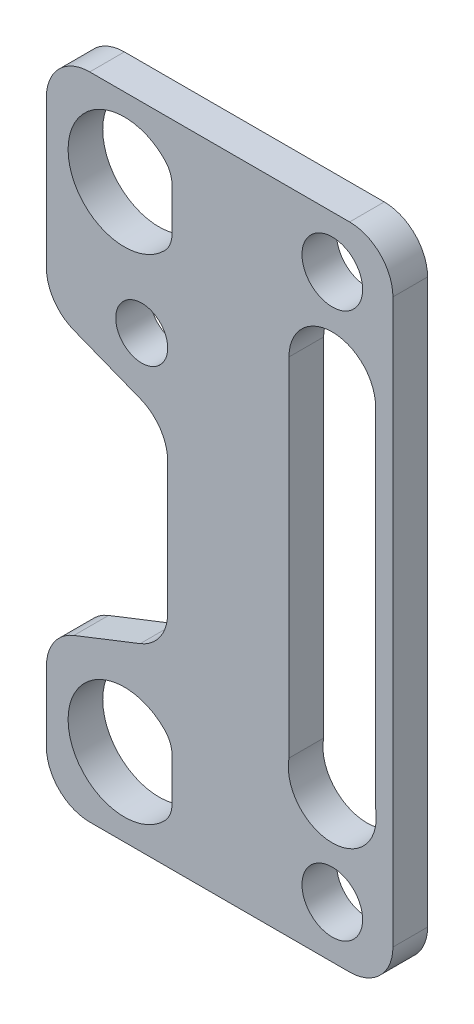
ISO-10303-21;
HEADER;
FILE_DESCRIPTION(('STEP AP214'),'2;1');
FILE_NAME('part.step','',(''),(''),'','','');
FILE_SCHEMA(('AUTOMOTIVE_DESIGN { 1 0 10303 214 1 1 1 1 }'));
ENDSEC;
DATA;
#1=APPLICATION_CONTEXT('core data for automotive mechanical design processes');
#2=APPLICATION_PROTOCOL_DEFINITION('international standard','automotive_design',2000,#1);
#3=PRODUCT_CONTEXT('',#1,'mechanical');
#4=PRODUCT('Part','Part','',(#3));
#5=PRODUCT_RELATED_PRODUCT_CATEGORY('part','',(#4));
#6=PRODUCT_DEFINITION_FORMATION('','',#4);
#7=PRODUCT_DEFINITION_CONTEXT('part definition',#1,'design');
#8=PRODUCT_DEFINITION('design','',#6,#7);
#9=PRODUCT_DEFINITION_SHAPE('','',#8);
#10=(LENGTH_UNIT() NAMED_UNIT(*) SI_UNIT(.MILLI.,.METRE.));
#11=(NAMED_UNIT(*) PLANE_ANGLE_UNIT() SI_UNIT($,.RADIAN.));
#12=(NAMED_UNIT(*) SI_UNIT($,.STERADIAN.) SOLID_ANGLE_UNIT());
#13=UNCERTAINTY_MEASURE_WITH_UNIT(LENGTH_MEASURE(1.E-05),#10,'distance_accuracy_value','');
#14=(GEOMETRIC_REPRESENTATION_CONTEXT(3) GLOBAL_UNCERTAINTY_ASSIGNED_CONTEXT((#13)) GLOBAL_UNIT_ASSIGNED_CONTEXT((#10,
#11,#12)) REPRESENTATION_CONTEXT('',''));
#15=CARTESIAN_POINT('',(0.,0.,0.));
#16=DIRECTION('',(0.,0.,1.));
#17=DIRECTION('',(1.,0.,0.));
#18=AXIS2_PLACEMENT_3D('',#15,#16,#17);
#19=CARTESIAN_POINT('',(0.,0.,4.));
#20=DIRECTION('',(1.,0.,0.));
#21=DIRECTION('',(0.,0.,-1.));
#22=AXIS2_PLACEMENT_3D('',#19,#20,#21);
#23=PLANE('',#22);
#24=DIRECTION('',(0.,-1.,0.));
#25=VECTOR('',#24,1.);
#26=CARTESIAN_POINT('',(0.,0.,4.));
#27=LINE('',#26,#25);
#28=CARTESIAN_POINT('',(0.,70.,4.));
#29=VERTEX_POINT('',#28);
#30=CARTESIAN_POINT('',(0.,52.9077174844612,4.));
#31=VERTEX_POINT('',#30);
#32=EDGE_CURVE('E308',#29,#31,#27,.T.);
#33=ORIENTED_EDGE('',*,*,#32,.F.);
#34=DIRECTION('',(0.,0.,-1.));
#35=VECTOR('',#34,1.);
#36=CARTESIAN_POINT('',(0.,70.,4.));
#37=LINE('',#36,#35);
#38=CARTESIAN_POINT('',(0.,70.,0.));
#39=VERTEX_POINT('',#38);
#40=EDGE_CURVE('E375',#29,#39,#37,.T.);
#41=ORIENTED_EDGE('',*,*,#40,.T.);
#42=DIRECTION('',(0.,-1.,0.));
#43=VECTOR('',#42,1.);
#44=CARTESIAN_POINT('',(0.,0.,0.));
#45=LINE('',#44,#43);
#46=CARTESIAN_POINT('',(0.,52.9077174844612,0.));
#47=VERTEX_POINT('',#46);
#48=EDGE_CURVE('E324',#39,#47,#45,.T.);
#49=ORIENTED_EDGE('',*,*,#48,.T.);
#50=DIRECTION('',(0.,0.,1.));
#51=VECTOR('',#50,1.);
#52=CARTESIAN_POINT('',(0.,52.9077174844612,4.));
#53=LINE('',#52,#51);
#54=EDGE_CURVE('E372',#47,#31,#53,.T.);
#55=ORIENTED_EDGE('',*,*,#54,.T.);
#56=EDGE_LOOP('',(#33,#41,#49,#55));
#57=FACE_BOUND('',#56,.T.);
#58=ADVANCED_FACE('F34',(#57),#23,.F.);
#59=CARTESIAN_POINT('',(0.,0.,4.));
#60=DIRECTION('',(0.,0.,-1.));
#61=DIRECTION('',(-1.,0.,0.));
#62=AXIS2_PLACEMENT_3D('',#59,#60,#61);
#63=PLANE('',#62);
#64=CARTESIAN_POINT('',(9.,9.,4.));
#65=DIRECTION('',(0.,0.,1.));
#66=DIRECTION('',(1.,0.,0.));
#67=AXIS2_PLACEMENT_3D('',#64,#65,#66);
#68=CIRCLE('',#67,6.5);
#69=CARTESIAN_POINT('',(13.6428571428571,13.5490523794545,4.));
#70=VERTEX_POINT('',#69);
#71=CARTESIAN_POINT('',(13.6428571428571,4.45094762054552,4.));
#72=VERTEX_POINT('',#71);
#73=EDGE_CURVE('E276',#70,#72,#68,.T.);
#74=ORIENTED_EDGE('',*,*,#73,.F.);
#75=CARTESIAN_POINT('',(11.5,11.4494897427832,4.));
#76=DIRECTION('',(0.,0.,-1.));
#77=DIRECTION('',(-1.,0.,0.));
#78=AXIS2_PLACEMENT_3D('',#75,#76,#77);
#79=CIRCLE('',#78,3.);
#80=CARTESIAN_POINT('',(14.5,11.4494897427832,4.));
#81=VERTEX_POINT('',#80);
#82=EDGE_CURVE('E434',#70,#81,#79,.T.);
#83=ORIENTED_EDGE('',*,*,#82,.T.);
#84=DIRECTION('',(0.,-1.,0.));
#85=VECTOR('',#84,1.);
#86=CARTESIAN_POINT('',(14.5,16.4524191540707,4.));
#87=LINE('',#86,#85);
#88=CARTESIAN_POINT('',(14.5,6.55051025721682,4.));
#89=VERTEX_POINT('',#88);
#90=EDGE_CURVE('E587',#81,#89,#87,.T.);
#91=ORIENTED_EDGE('',*,*,#90,.T.);
#92=CARTESIAN_POINT('',(11.5,6.55051025721682,4.));
#93=DIRECTION('',(0.,0.,-1.));
#94=DIRECTION('',(-1.,0.,0.));
#95=AXIS2_PLACEMENT_3D('',#92,#93,#94);
#96=CIRCLE('',#95,3.);
#97=EDGE_CURVE('E432',#89,#72,#96,.T.);
#98=ORIENTED_EDGE('',*,*,#97,.T.);
#99=EDGE_LOOP('',(#74,#83,#91,#98));
#100=FACE_BOUND('',#99,.T.);
#101=CARTESIAN_POINT('',(8.99999999999999,66.,4.));
#102=DIRECTION('',(0.,0.,1.));
#103=DIRECTION('',(1.,0.,0.));
#104=AXIS2_PLACEMENT_3D('',#101,#102,#103);
#105=CIRCLE('',#104,6.50000000000001);
#106=CARTESIAN_POINT('',(13.6428571428571,70.5490523794545,4.));
#107=VERTEX_POINT('',#106);
#108=CARTESIAN_POINT('',(13.6428571428571,61.4509476205455,4.));
#109=VERTEX_POINT('',#108);
#110=EDGE_CURVE('E280',#107,#109,#105,.T.);
#111=ORIENTED_EDGE('',*,*,#110,.F.);
#112=CARTESIAN_POINT('',(11.5,68.4494897427832,4.));
#113=DIRECTION('',(0.,0.,-1.));
#114=DIRECTION('',(-1.,0.,0.));
#115=AXIS2_PLACEMENT_3D('',#112,#113,#114);
#116=CIRCLE('',#115,3.);
#117=CARTESIAN_POINT('',(14.5,68.4494897427832,4.));
#118=VERTEX_POINT('',#117);
#119=EDGE_CURVE('E42',#107,#118,#116,.T.);
#120=ORIENTED_EDGE('',*,*,#119,.T.);
#121=DIRECTION('',(0.,-1.,0.));
#122=VECTOR('',#121,1.);
#123=CARTESIAN_POINT('',(14.5,71.691919872241,4.));
#124=LINE('',#123,#122);
#125=CARTESIAN_POINT('',(14.5,63.5505102572168,4.));
#126=VERTEX_POINT('',#125);
#127=EDGE_CURVE('E247',#118,#126,#124,.T.);
#128=ORIENTED_EDGE('',*,*,#127,.T.);
#129=CARTESIAN_POINT('',(11.5,63.5505102572168,4.));
#130=DIRECTION('',(0.,0.,-1.));
#131=DIRECTION('',(-1.,0.,0.));
#132=AXIS2_PLACEMENT_3D('',#129,#130,#131);
#133=CIRCLE('',#132,3.);
#134=EDGE_CURVE('E439',#126,#109,#133,.T.);
#135=ORIENTED_EDGE('',*,*,#134,.T.);
#136=EDGE_LOOP('',(#111,#120,#128,#135));
#137=FACE_BOUND('',#136,.T.);
#138=DIRECTION('',(0.,-1.,0.));
#139=VECTOR('',#138,1.);
#140=CARTESIAN_POINT('',(28.,58.,4.));
#141=LINE('',#140,#139);
#142=CARTESIAN_POINT('',(28.,58.,4.));
#143=VERTEX_POINT('',#142);
#144=CARTESIAN_POINT('',(28.,17.9014467678342,4.));
#145=VERTEX_POINT('',#144);
#146=EDGE_CURVE('E257',#143,#145,#141,.T.);
#147=ORIENTED_EDGE('',*,*,#146,.F.);
#148=CARTESIAN_POINT('',(33.,58.,4.));
#149=DIRECTION('',(0.,0.,1.));
#150=DIRECTION('',(1.,0.,0.));
#151=AXIS2_PLACEMENT_3D('',#148,#149,#150);
#152=CIRCLE('',#151,5.);
#153=CARTESIAN_POINT('',(38.,58.,4.));
#154=VERTEX_POINT('',#153);
#155=EDGE_CURVE('E227',#154,#143,#152,.T.);
#156=ORIENTED_EDGE('',*,*,#155,.F.);
#157=DIRECTION('',(0.,1.,0.));
#158=VECTOR('',#157,1.);
#159=CARTESIAN_POINT('',(38.,17.9014467678342,4.));
#160=LINE('',#159,#158);
#161=CARTESIAN_POINT('',(38.,17.9014467678342,4.));
#162=VERTEX_POINT('',#161);
#163=EDGE_CURVE('E409',#162,#154,#160,.T.);
#164=ORIENTED_EDGE('',*,*,#163,.F.);
#165=CARTESIAN_POINT('',(33.,17.,4.));
#166=DIRECTION('',(0.,0.,1.));
#167=DIRECTION('',(1.,0.,0.));
#168=AXIS2_PLACEMENT_3D('',#165,#166,#167);
#169=CIRCLE('',#168,5.08061081713988);
#170=EDGE_CURVE('E407',#145,#162,#169,.T.);
#171=ORIENTED_EDGE('',*,*,#170,.F.);
#172=EDGE_LOOP('',(#147,#156,#164,#171));
#173=FACE_BOUND('',#172,.T.);
#174=CARTESIAN_POINT('',(33.,6.,4.));
#175=DIRECTION('',(0.,0.,1.));
#176=DIRECTION('',(1.,0.,0.));
#177=AXIS2_PLACEMENT_3D('',#174,#175,#176);
#178=CIRCLE('',#177,3.5);
#179=CARTESIAN_POINT('',(36.5,6.,4.));
#180=VERTEX_POINT('',#179);
#181=EDGE_CURVE('E264',#180,#180,#178,.T.);
#182=ORIENTED_EDGE('',*,*,#181,.F.);
#183=EDGE_LOOP('',(#182));
#184=FACE_BOUND('',#183,.T.);
#185=CARTESIAN_POINT('',(33.,69.,4.));
#186=DIRECTION('',(0.,0.,1.));
#187=DIRECTION('',(1.,0.,0.));
#188=AXIS2_PLACEMENT_3D('',#185,#186,#187);
#189=CIRCLE('',#188,3.5);
#190=CARTESIAN_POINT('',(36.5,69.,4.));
#191=VERTEX_POINT('',#190);
#192=EDGE_CURVE('E263',#191,#191,#189,.T.);
#193=ORIENTED_EDGE('',*,*,#192,.F.);
#194=EDGE_LOOP('',(#193));
#195=FACE_BOUND('',#194,.T.);
#196=CARTESIAN_POINT('',(11.,51.8905235434662,4.));
#197=DIRECTION('',(0.,0.,1.));
#198=DIRECTION('',(1.,0.,0.));
#199=AXIS2_PLACEMENT_3D('',#196,#197,#198);
#200=CIRCLE('',#199,3.);
#201=CARTESIAN_POINT('',(14.,51.8905235434662,4.));
#202=VERTEX_POINT('',#201);
#203=EDGE_CURVE('E273',#202,#202,#200,.T.);
#204=ORIENTED_EDGE('',*,*,#203,.F.);
#205=EDGE_LOOP('',(#204));
#206=FACE_BOUND('',#205,.T.);
#207=DIRECTION('',(1.,0.,0.));
#208=VECTOR('',#207,1.);
#209=CARTESIAN_POINT('',(0.,0.,4.));
#210=LINE('',#209,#208);
#211=CARTESIAN_POINT('',(5.,0.,4.));
#212=VERTEX_POINT('',#211);
#213=CARTESIAN_POINT('',(35.,0.,4.));
#214=VERTEX_POINT('',#213);
#215=EDGE_CURVE('E311',#212,#214,#210,.T.);
#216=ORIENTED_EDGE('',*,*,#215,.T.);
#217=CARTESIAN_POINT('',(35.,5.,4.));
#218=DIRECTION('',(0.,0.,-1.));
#219=DIRECTION('',(-1.,0.,0.));
#220=AXIS2_PLACEMENT_3D('',#217,#218,#219);
#221=CIRCLE('',#220,5.);
#222=CARTESIAN_POINT('',(40.,5.,4.));
#223=VERTEX_POINT('',#222);
#224=EDGE_CURVE('E365',#214,#223,#221,.F.);
#225=ORIENTED_EDGE('',*,*,#224,.T.);
#226=DIRECTION('',(0.,1.,0.));
#227=VECTOR('',#226,1.);
#228=CARTESIAN_POINT('',(40.,0.,4.));
#229=LINE('',#228,#227);
#230=CARTESIAN_POINT('',(40.,70.,4.));
#231=VERTEX_POINT('',#230);
#232=EDGE_CURVE('E315',#223,#231,#229,.T.);
#233=ORIENTED_EDGE('',*,*,#232,.T.);
#234=CARTESIAN_POINT('',(35.,70.,4.));
#235=DIRECTION('',(0.,0.,-1.));
#236=DIRECTION('',(-1.,0.,0.));
#237=AXIS2_PLACEMENT_3D('',#234,#235,#236);
#238=CIRCLE('',#237,5.);
#239=CARTESIAN_POINT('',(35.,75.,4.));
#240=VERTEX_POINT('',#239);
#241=EDGE_CURVE('E363',#231,#240,#238,.F.);
#242=ORIENTED_EDGE('',*,*,#241,.T.);
#243=DIRECTION('',(-1.,0.,0.));
#244=VECTOR('',#243,1.);
#245=CARTESIAN_POINT('',(0.,75.,4.));
#246=LINE('',#245,#244);
#247=CARTESIAN_POINT('',(5.,75.,4.));
#248=VERTEX_POINT('',#247);
#249=EDGE_CURVE('E318',#240,#248,#246,.T.);
#250=ORIENTED_EDGE('',*,*,#249,.T.);
#251=CARTESIAN_POINT('',(5.,70.,4.));
#252=DIRECTION('',(0.,0.,-1.));
#253=DIRECTION('',(-1.,0.,0.));
#254=AXIS2_PLACEMENT_3D('',#251,#252,#253);
#255=CIRCLE('',#254,5.);
#256=EDGE_CURVE('E361',#248,#29,#255,.F.);
#257=ORIENTED_EDGE('',*,*,#256,.T.);
#258=ORIENTED_EDGE('',*,*,#32,.T.);
#259=CARTESIAN_POINT('',(5.,52.9077174844612,4.));
#260=DIRECTION('',(0.,0.,-1.));
#261=DIRECTION('',(-1.,0.,0.));
#262=AXIS2_PLACEMENT_3D('',#259,#260,#261);
#263=CIRCLE('',#262,5.);
#264=CARTESIAN_POINT('',(3.17173813788503,48.2539600172595,4.));
#265=VERTEX_POINT('',#264);
#266=EDGE_CURVE('E355',#31,#265,#263,.F.);
#267=ORIENTED_EDGE('',*,*,#266,.T.);
#268=DIRECTION('',(0.930751493440347,-0.365652372422993,0.));
#269=VECTOR('',#268,1.);
#270=CARTESIAN_POINT('',(0.,49.5,4.));
#271=LINE('',#270,#269);
#272=CARTESIAN_POINT('',(10.828261862115,45.2460399827405,4.));
#273=VERTEX_POINT('',#272);
#274=EDGE_CURVE('E287',#265,#273,#271,.T.);
#275=ORIENTED_EDGE('',*,*,#274,.T.);
#276=CARTESIAN_POINT('',(9.,40.5922825155388,4.));
#277=DIRECTION('',(0.,0.,-1.));
#278=DIRECTION('',(-1.,0.,0.));
#279=AXIS2_PLACEMENT_3D('',#276,#277,#278);
#280=CIRCLE('',#279,5.);
#281=CARTESIAN_POINT('',(14.,40.5922825155388,4.));
#282=VERTEX_POINT('',#281);
#283=EDGE_CURVE('E401',#273,#282,#280,.T.);
#284=ORIENTED_EDGE('',*,*,#283,.T.);
#285=DIRECTION('',(0.,-1.,0.));
#286=VECTOR('',#285,1.);
#287=CARTESIAN_POINT('',(14.,44.,4.));
#288=LINE('',#287,#286);
#289=CARTESIAN_POINT('',(14.,25.4077174844612,4.));
#290=VERTEX_POINT('',#289);
#291=EDGE_CURVE('E303',#282,#290,#288,.T.);
#292=ORIENTED_EDGE('',*,*,#291,.T.);
#293=CARTESIAN_POINT('',(9.,25.4077174844612,4.));
#294=DIRECTION('',(0.,0.,-1.));
#295=DIRECTION('',(-1.,0.,0.));
#296=AXIS2_PLACEMENT_3D('',#293,#294,#295);
#297=CIRCLE('',#296,5.);
#298=CARTESIAN_POINT('',(10.828261862115,20.7539600172594,4.));
#299=VERTEX_POINT('',#298);
#300=EDGE_CURVE('E397',#290,#299,#297,.T.);
#301=ORIENTED_EDGE('',*,*,#300,.T.);
#302=DIRECTION('',(0.930751493440347,0.365652372422993,0.));
#303=VECTOR('',#302,1.);
#304=CARTESIAN_POINT('',(0.,16.5,4.));
#305=LINE('',#304,#303);
#306=CARTESIAN_POINT('',(3.17173813788503,17.7460399827405,4.));
#307=VERTEX_POINT('',#306);
#308=EDGE_CURVE('E294',#307,#299,#305,.T.);
#309=ORIENTED_EDGE('',*,*,#308,.F.);
#310=CARTESIAN_POINT('',(5.,13.0922825155388,4.));
#311=DIRECTION('',(0.,0.,-1.));
#312=DIRECTION('',(-1.,0.,0.));
#313=AXIS2_PLACEMENT_3D('',#310,#311,#312);
#314=CIRCLE('',#313,5.);
#315=CARTESIAN_POINT('',(0.,13.0922825155388,4.));
#316=VERTEX_POINT('',#315);
#317=EDGE_CURVE('E357',#307,#316,#314,.F.);
#318=ORIENTED_EDGE('',*,*,#317,.T.);
#319=CARTESIAN_POINT('',(0.,5.,4.));
#320=VERTEX_POINT('',#319);
#321=EDGE_CURVE('E312',#316,#320,#27,.T.);
#322=ORIENTED_EDGE('',*,*,#321,.T.);
#323=CARTESIAN_POINT('',(5.,5.,4.));
#324=DIRECTION('',(0.,0.,-1.));
#325=DIRECTION('',(-1.,0.,0.));
#326=AXIS2_PLACEMENT_3D('',#323,#324,#325);
#327=CIRCLE('',#326,5.);
#328=EDGE_CURVE('E359',#320,#212,#327,.F.);
#329=ORIENTED_EDGE('',*,*,#328,.T.);
#330=EDGE_LOOP('',(#216,#225,#233,#242,#250,#257,#258,#267,#275,#284,#292,#301,#309,#318,#322,#329));
#331=FACE_BOUND('',#330,.T.);
#332=ADVANCED_FACE('F443',(#100,#137,#173,#184,#195,#206,#331),#63,.F.);
#333=CARTESIAN_POINT('',(0.,0.,0.));
#334=DIRECTION('',(0.,0.,-1.));
#335=DIRECTION('',(-1.,0.,0.));
#336=AXIS2_PLACEMENT_3D('',#333,#334,#335);
#337=PLANE('',#336);
#338=DIRECTION('',(0.,-1.,0.));
#339=VECTOR('',#338,1.);
#340=CARTESIAN_POINT('',(14.5,16.4524191540707,0.));
#341=LINE('',#340,#339);
#342=CARTESIAN_POINT('',(14.5,11.4494897427832,0.));
#343=VERTEX_POINT('',#342);
#344=CARTESIAN_POINT('',(14.5,6.55051025721682,0.));
#345=VERTEX_POINT('',#344);
#346=EDGE_CURVE('E450',#343,#345,#341,.T.);
#347=ORIENTED_EDGE('',*,*,#346,.F.);
#348=CARTESIAN_POINT('',(11.5,11.4494897427832,0.));
#349=DIRECTION('',(0.,0.,-1.));
#350=DIRECTION('',(-1.,0.,0.));
#351=AXIS2_PLACEMENT_3D('',#348,#349,#350);
#352=CIRCLE('',#351,3.);
#353=CARTESIAN_POINT('',(13.6428571428571,13.5490523794545,0.));
#354=VERTEX_POINT('',#353);
#355=EDGE_CURVE('E436',#343,#354,#352,.F.);
#356=ORIENTED_EDGE('',*,*,#355,.T.);
#357=CARTESIAN_POINT('',(9.,9.,0.));
#358=DIRECTION('',(0.,0.,1.));
#359=DIRECTION('',(1.,0.,0.));
#360=AXIS2_PLACEMENT_3D('',#357,#358,#359);
#361=CIRCLE('',#360,6.5);
#362=CARTESIAN_POINT('',(13.6428571428571,4.45094762054552,0.));
#363=VERTEX_POINT('',#362);
#364=EDGE_CURVE('E284',#354,#363,#361,.T.);
#365=ORIENTED_EDGE('',*,*,#364,.T.);
#366=CARTESIAN_POINT('',(11.5,6.55051025721682,0.));
#367=DIRECTION('',(0.,0.,-1.));
#368=DIRECTION('',(-1.,0.,0.));
#369=AXIS2_PLACEMENT_3D('',#366,#367,#368);
#370=CIRCLE('',#369,3.);
#371=EDGE_CURVE('E430',#363,#345,#370,.F.);
#372=ORIENTED_EDGE('',*,*,#371,.T.);
#373=EDGE_LOOP('',(#347,#356,#365,#372));
#374=FACE_BOUND('',#373,.T.);
#375=DIRECTION('',(0.,-1.,0.));
#376=VECTOR('',#375,1.);
#377=CARTESIAN_POINT('',(14.5,71.691919872241,0.));
#378=LINE('',#377,#376);
#379=CARTESIAN_POINT('',(14.5,68.4494897427832,0.));
#380=VERTEX_POINT('',#379);
#381=CARTESIAN_POINT('',(14.5,63.5505102572168,0.));
#382=VERTEX_POINT('',#381);
#383=EDGE_CURVE('E245',#380,#382,#378,.T.);
#384=ORIENTED_EDGE('',*,*,#383,.F.);
#385=CARTESIAN_POINT('',(11.5,68.4494897427832,0.));
#386=DIRECTION('',(0.,0.,-1.));
#387=DIRECTION('',(-1.,0.,0.));
#388=AXIS2_PLACEMENT_3D('',#385,#386,#387);
#389=CIRCLE('',#388,3.);
#390=CARTESIAN_POINT('',(13.6428571428571,70.5490523794545,0.));
#391=VERTEX_POINT('',#390);
#392=EDGE_CURVE('E11',#380,#391,#389,.F.);
#393=ORIENTED_EDGE('',*,*,#392,.T.);
#394=CARTESIAN_POINT('',(8.99999999999999,66.,0.));
#395=DIRECTION('',(0.,0.,1.));
#396=DIRECTION('',(1.,0.,0.));
#397=AXIS2_PLACEMENT_3D('',#394,#395,#396);
#398=CIRCLE('',#397,6.50000000000001);
#399=CARTESIAN_POINT('',(13.6428571428571,61.4509476205455,0.));
#400=VERTEX_POINT('',#399);
#401=EDGE_CURVE('E270',#391,#400,#398,.T.);
#402=ORIENTED_EDGE('',*,*,#401,.T.);
#403=CARTESIAN_POINT('',(11.5,63.5505102572168,0.));
#404=DIRECTION('',(0.,0.,-1.));
#405=DIRECTION('',(-1.,0.,0.));
#406=AXIS2_PLACEMENT_3D('',#403,#404,#405);
#407=CIRCLE('',#406,3.);
#408=EDGE_CURVE('E49',#400,#382,#407,.F.);
#409=ORIENTED_EDGE('',*,*,#408,.T.);
#410=EDGE_LOOP('',(#384,#393,#402,#409));
#411=FACE_BOUND('',#410,.T.);
#412=CARTESIAN_POINT('',(33.,58.,0.));
#413=DIRECTION('',(0.,0.,1.));
#414=DIRECTION('',(-1.,0.,0.));
#415=AXIS2_PLACEMENT_3D('',#412,#413,#414);
#416=CIRCLE('',#415,5.);
#417=CARTESIAN_POINT('',(38.,58.,0.));
#418=VERTEX_POINT('',#417);
#419=CARTESIAN_POINT('',(28.,58.,0.));
#420=VERTEX_POINT('',#419);
#421=EDGE_CURVE('E224',#418,#420,#416,.T.);
#422=ORIENTED_EDGE('',*,*,#421,.T.);
#423=DIRECTION('',(0.,-1.,0.));
#424=VECTOR('',#423,1.);
#425=CARTESIAN_POINT('',(28.,58.,0.));
#426=LINE('',#425,#424);
#427=CARTESIAN_POINT('',(28.,17.9014467678341,0.));
#428=VERTEX_POINT('',#427);
#429=EDGE_CURVE('E235',#420,#428,#426,.T.);
#430=ORIENTED_EDGE('',*,*,#429,.T.);
#431=CARTESIAN_POINT('',(33.,17.,0.));
#432=DIRECTION('',(0.,0.,1.));
#433=DIRECTION('',(1.,0.,0.));
#434=AXIS2_PLACEMENT_3D('',#431,#432,#433);
#435=CIRCLE('',#434,5.08061081713988);
#436=CARTESIAN_POINT('',(38.,17.9014467678342,0.));
#437=VERTEX_POINT('',#436);
#438=EDGE_CURVE('E240',#428,#437,#435,.T.);
#439=ORIENTED_EDGE('',*,*,#438,.T.);
#440=DIRECTION('',(0.,1.,0.));
#441=VECTOR('',#440,1.);
#442=CARTESIAN_POINT('',(38.,17.9014467678342,0.));
#443=LINE('',#442,#441);
#444=EDGE_CURVE('E231',#437,#418,#443,.T.);
#445=ORIENTED_EDGE('',*,*,#444,.T.);
#446=EDGE_LOOP('',(#422,#430,#439,#445));
#447=FACE_BOUND('',#446,.T.);
#448=CARTESIAN_POINT('',(33.,6.,0.));
#449=DIRECTION('',(0.,0.,1.));
#450=DIRECTION('',(1.,0.,0.));
#451=AXIS2_PLACEMENT_3D('',#448,#449,#450);
#452=CIRCLE('',#451,3.5);
#453=CARTESIAN_POINT('',(36.5,6.,0.));
#454=VERTEX_POINT('',#453);
#455=EDGE_CURVE('E260',#454,#454,#452,.T.);
#456=ORIENTED_EDGE('',*,*,#455,.T.);
#457=EDGE_LOOP('',(#456));
#458=FACE_BOUND('',#457,.T.);
#459=CARTESIAN_POINT('',(33.,69.,0.));
#460=DIRECTION('',(0.,0.,1.));
#461=DIRECTION('',(1.,0.,0.));
#462=AXIS2_PLACEMENT_3D('',#459,#460,#461);
#463=CIRCLE('',#462,3.5);
#464=CARTESIAN_POINT('',(36.5,69.,0.));
#465=VERTEX_POINT('',#464);
#466=EDGE_CURVE('E267',#465,#465,#463,.T.);
#467=ORIENTED_EDGE('',*,*,#466,.T.);
#468=EDGE_LOOP('',(#467));
#469=FACE_BOUND('',#468,.T.);
#470=CARTESIAN_POINT('',(11.,51.8905235434662,0.));
#471=DIRECTION('',(0.,0.,1.));
#472=DIRECTION('',(1.,0.,0.));
#473=AXIS2_PLACEMENT_3D('',#470,#471,#472);
#474=CIRCLE('',#473,3.);
#475=CARTESIAN_POINT('',(14.,51.8905235434662,0.));
#476=VERTEX_POINT('',#475);
#477=EDGE_CURVE('E277',#476,#476,#474,.T.);
#478=ORIENTED_EDGE('',*,*,#477,.T.);
#479=EDGE_LOOP('',(#478));
#480=FACE_BOUND('',#479,.T.);
#481=DIRECTION('',(0.,1.,0.));
#482=VECTOR('',#481,1.);
#483=CARTESIAN_POINT('',(40.,0.,0.));
#484=LINE('',#483,#482);
#485=CARTESIAN_POINT('',(40.,5.,0.));
#486=VERTEX_POINT('',#485);
#487=CARTESIAN_POINT('',(40.,70.,0.));
#488=VERTEX_POINT('',#487);
#489=EDGE_CURVE('E328',#486,#488,#484,.T.);
#490=ORIENTED_EDGE('',*,*,#489,.F.);
#491=CARTESIAN_POINT('',(35.,5.,0.));
#492=DIRECTION('',(0.,0.,-1.));
#493=DIRECTION('',(-1.,0.,0.));
#494=AXIS2_PLACEMENT_3D('',#491,#492,#493);
#495=CIRCLE('',#494,5.);
#496=CARTESIAN_POINT('',(35.,0.,0.));
#497=VERTEX_POINT('',#496);
#498=EDGE_CURVE('E348',#486,#497,#495,.T.);
#499=ORIENTED_EDGE('',*,*,#498,.T.);
#500=DIRECTION('',(1.,0.,0.));
#501=VECTOR('',#500,1.);
#502=CARTESIAN_POINT('',(0.,0.,0.));
#503=LINE('',#502,#501);
#504=CARTESIAN_POINT('',(5.,0.,0.));
#505=VERTEX_POINT('',#504);
#506=EDGE_CURVE('E325',#505,#497,#503,.T.);
#507=ORIENTED_EDGE('',*,*,#506,.F.);
#508=CARTESIAN_POINT('',(5.,5.,0.));
#509=DIRECTION('',(0.,0.,-1.));
#510=DIRECTION('',(-1.,0.,0.));
#511=AXIS2_PLACEMENT_3D('',#508,#509,#510);
#512=CIRCLE('',#511,5.);
#513=CARTESIAN_POINT('',(0.,5.,0.));
#514=VERTEX_POINT('',#513);
#515=EDGE_CURVE('E342',#505,#514,#512,.T.);
#516=ORIENTED_EDGE('',*,*,#515,.T.);
#517=CARTESIAN_POINT('',(0.,13.0922825155388,0.));
#518=VERTEX_POINT('',#517);
#519=EDGE_CURVE('E300',#518,#514,#45,.T.);
#520=ORIENTED_EDGE('',*,*,#519,.F.);
#521=CARTESIAN_POINT('',(5.,13.0922825155388,0.));
#522=DIRECTION('',(0.,0.,-1.));
#523=DIRECTION('',(-1.,0.,0.));
#524=AXIS2_PLACEMENT_3D('',#521,#522,#523);
#525=CIRCLE('',#524,5.);
#526=CARTESIAN_POINT('',(3.17173813788503,17.7460399827405,0.));
#527=VERTEX_POINT('',#526);
#528=EDGE_CURVE('E340',#518,#527,#525,.T.);
#529=ORIENTED_EDGE('',*,*,#528,.T.);
#530=DIRECTION('',(0.930751493440347,0.365652372422993,0.));
#531=VECTOR('',#530,1.);
#532=CARTESIAN_POINT('',(0.,16.5,0.));
#533=LINE('',#532,#531);
#534=CARTESIAN_POINT('',(10.828261862115,20.7539600172594,0.));
#535=VERTEX_POINT('',#534);
#536=EDGE_CURVE('E297',#527,#535,#533,.T.);
#537=ORIENTED_EDGE('',*,*,#536,.T.);
#538=CARTESIAN_POINT('',(9.,25.4077174844612,0.));
#539=DIRECTION('',(0.,0.,-1.));
#540=DIRECTION('',(-1.,0.,0.));
#541=AXIS2_PLACEMENT_3D('',#538,#539,#540);
#542=CIRCLE('',#541,5.);
#543=CARTESIAN_POINT('',(14.,25.4077174844612,0.));
#544=VERTEX_POINT('',#543);
#545=EDGE_CURVE('E399',#535,#544,#542,.F.);
#546=ORIENTED_EDGE('',*,*,#545,.T.);
#547=DIRECTION('',(0.,-1.,0.));
#548=VECTOR('',#547,1.);
#549=CARTESIAN_POINT('',(14.,44.,0.));
#550=LINE('',#549,#548);
#551=CARTESIAN_POINT('',(14.,40.5922825155388,0.));
#552=VERTEX_POINT('',#551);
#553=EDGE_CURVE('E293',#552,#544,#550,.T.);
#554=ORIENTED_EDGE('',*,*,#553,.F.);
#555=CARTESIAN_POINT('',(9.,40.5922825155388,0.));
#556=DIRECTION('',(0.,0.,-1.));
#557=DIRECTION('',(-1.,0.,0.));
#558=AXIS2_PLACEMENT_3D('',#555,#556,#557);
#559=CIRCLE('',#558,5.);
#560=CARTESIAN_POINT('',(10.828261862115,45.2460399827405,0.));
#561=VERTEX_POINT('',#560);
#562=EDGE_CURVE('E403',#552,#561,#559,.F.);
#563=ORIENTED_EDGE('',*,*,#562,.T.);
#564=DIRECTION('',(0.930751493440347,-0.365652372422993,0.));
#565=VECTOR('',#564,1.);
#566=CARTESIAN_POINT('',(0.,49.5,0.));
#567=LINE('',#566,#565);
#568=CARTESIAN_POINT('',(3.17173813788503,48.2539600172595,0.));
#569=VERTEX_POINT('',#568);
#570=EDGE_CURVE('E290',#569,#561,#567,.T.);
#571=ORIENTED_EDGE('',*,*,#570,.F.);
#572=CARTESIAN_POINT('',(5.,52.9077174844612,0.));
#573=DIRECTION('',(0.,0.,-1.));
#574=DIRECTION('',(-1.,0.,0.));
#575=AXIS2_PLACEMENT_3D('',#572,#573,#574);
#576=CIRCLE('',#575,5.);
#577=EDGE_CURVE('E338',#569,#47,#576,.T.);
#578=ORIENTED_EDGE('',*,*,#577,.T.);
#579=ORIENTED_EDGE('',*,*,#48,.F.);
#580=CARTESIAN_POINT('',(5.,70.,0.));
#581=DIRECTION('',(0.,0.,-1.));
#582=DIRECTION('',(-1.,0.,0.));
#583=AXIS2_PLACEMENT_3D('',#580,#581,#582);
#584=CIRCLE('',#583,5.);
#585=CARTESIAN_POINT('',(5.,75.,0.));
#586=VERTEX_POINT('',#585);
#587=EDGE_CURVE('E344',#39,#586,#584,.T.);
#588=ORIENTED_EDGE('',*,*,#587,.T.);
#589=DIRECTION('',(-1.,0.,0.));
#590=VECTOR('',#589,1.);
#591=CARTESIAN_POINT('',(0.,75.,0.));
#592=LINE('',#591,#590);
#593=CARTESIAN_POINT('',(35.,75.,0.));
#594=VERTEX_POINT('',#593);
#595=EDGE_CURVE('E331',#594,#586,#592,.T.);
#596=ORIENTED_EDGE('',*,*,#595,.F.);
#597=CARTESIAN_POINT('',(35.,70.,0.));
#598=DIRECTION('',(0.,0.,-1.));
#599=DIRECTION('',(-1.,0.,0.));
#600=AXIS2_PLACEMENT_3D('',#597,#598,#599);
#601=CIRCLE('',#600,5.);
#602=EDGE_CURVE('E346',#594,#488,#601,.T.);
#603=ORIENTED_EDGE('',*,*,#602,.T.);
#604=EDGE_LOOP('',(#490,#499,#507,#516,#520,#529,#537,#546,#554,#563,#571,#578,#579,#588,#596,#603));
#605=FACE_BOUND('',#604,.T.);
#606=ADVANCED_FACE('F242',(#374,#411,#447,#458,#469,#480,#605),#337,.T.);
#607=ORIENTED_EDGE('',*,*,#519,.T.);
#608=DIRECTION('',(0.,0.,-1.));
#609=VECTOR('',#608,1.);
#610=CARTESIAN_POINT('',(0.,5.,4.));
#611=LINE('',#610,#609);
#612=EDGE_CURVE('E380',#514,#320,#611,.F.);
#613=ORIENTED_EDGE('',*,*,#612,.T.);
#614=ORIENTED_EDGE('',*,*,#321,.F.);
#615=DIRECTION('',(0.,0.,1.));
#616=VECTOR('',#615,1.);
#617=CARTESIAN_POINT('',(0.,13.0922825155388,4.));
#618=LINE('',#617,#616);
#619=EDGE_CURVE('E378',#316,#518,#618,.F.);
#620=ORIENTED_EDGE('',*,*,#619,.T.);
#621=EDGE_LOOP('',(#607,#613,#614,#620));
#622=FACE_BOUND('',#621,.T.);
#623=ADVANCED_FACE('F470',(#622),#23,.F.);
#624=CARTESIAN_POINT('',(0.,0.,4.));
#625=DIRECTION('',(0.,1.,0.));
#626=DIRECTION('',(0.,0.,1.));
#627=AXIS2_PLACEMENT_3D('',#624,#625,#626);
#628=PLANE('',#627);
#629=ORIENTED_EDGE('',*,*,#506,.T.);
#630=DIRECTION('',(0.,0.,-1.));
#631=VECTOR('',#630,1.);
#632=CARTESIAN_POINT('',(35.,0.,4.));
#633=LINE('',#632,#631);
#634=EDGE_CURVE('E353',#497,#214,#633,.F.);
#635=ORIENTED_EDGE('',*,*,#634,.T.);
#636=ORIENTED_EDGE('',*,*,#215,.F.);
#637=DIRECTION('',(0.,0.,-1.));
#638=VECTOR('',#637,1.);
#639=CARTESIAN_POINT('',(5.,0.,4.));
#640=LINE('',#639,#638);
#641=EDGE_CURVE('E350',#212,#505,#640,.T.);
#642=ORIENTED_EDGE('',*,*,#641,.T.);
#643=EDGE_LOOP('',(#629,#635,#636,#642));
#644=FACE_BOUND('',#643,.T.);
#645=ADVANCED_FACE('F480',(#644),#628,.F.);
#646=CARTESIAN_POINT('',(40.,0.,4.));
#647=DIRECTION('',(-1.,0.,0.));
#648=DIRECTION('',(0.,0.,1.));
#649=AXIS2_PLACEMENT_3D('',#646,#647,#648);
#650=PLANE('',#649);
#651=ORIENTED_EDGE('',*,*,#232,.F.);
#652=DIRECTION('',(0.,0.,-1.));
#653=VECTOR('',#652,1.);
#654=CARTESIAN_POINT('',(40.,5.,4.));
#655=LINE('',#654,#653);
#656=EDGE_CURVE('E335',#223,#486,#655,.T.);
#657=ORIENTED_EDGE('',*,*,#656,.T.);
#658=ORIENTED_EDGE('',*,*,#489,.T.);
#659=DIRECTION('',(0.,0.,-1.));
#660=VECTOR('',#659,1.);
#661=CARTESIAN_POINT('',(40.,70.,4.));
#662=LINE('',#661,#660);
#663=EDGE_CURVE('E321',#488,#231,#662,.F.);
#664=ORIENTED_EDGE('',*,*,#663,.T.);
#665=EDGE_LOOP('',(#651,#657,#658,#664));
#666=FACE_BOUND('',#665,.T.);
#667=ADVANCED_FACE('F486',(#666),#650,.F.);
#668=CARTESIAN_POINT('',(0.,75.,4.));
#669=DIRECTION('',(0.,-1.,0.));
#670=DIRECTION('',(0.,0.,-1.));
#671=AXIS2_PLACEMENT_3D('',#668,#669,#670);
#672=PLANE('',#671);
#673=ORIENTED_EDGE('',*,*,#249,.F.);
#674=DIRECTION('',(0.,0.,-1.));
#675=VECTOR('',#674,1.);
#676=CARTESIAN_POINT('',(35.,75.,4.));
#677=LINE('',#676,#675);
#678=EDGE_CURVE('E369',#240,#594,#677,.T.);
#679=ORIENTED_EDGE('',*,*,#678,.T.);
#680=ORIENTED_EDGE('',*,*,#595,.T.);
#681=DIRECTION('',(0.,0.,-1.));
#682=VECTOR('',#681,1.);
#683=CARTESIAN_POINT('',(5.,75.,4.));
#684=LINE('',#683,#682);
#685=EDGE_CURVE('E367',#586,#248,#684,.F.);
#686=ORIENTED_EDGE('',*,*,#685,.T.);
#687=EDGE_LOOP('',(#673,#679,#680,#686));
#688=FACE_BOUND('',#687,.T.);
#689=ADVANCED_FACE('F520',(#688),#672,.F.);
#690=CARTESIAN_POINT('',(0.,49.5,0.));
#691=DIRECTION('',(-0.365652372422993,-0.930751493440347,0.));
#692=DIRECTION('',(0.930751493440347,-0.365652372422993,0.));
#693=AXIS2_PLACEMENT_3D('',#690,#691,#692);
#694=PLANE('',#693);
#695=ORIENTED_EDGE('',*,*,#570,.T.);
#696=DIRECTION('',(0.,0.,1.));
#697=VECTOR('',#696,1.);
#698=CARTESIAN_POINT('',(10.828261862115,45.2460399827405,4.));
#699=LINE('',#698,#697);
#700=EDGE_CURVE('E394',#561,#273,#699,.T.);
#701=ORIENTED_EDGE('',*,*,#700,.T.);
#702=ORIENTED_EDGE('',*,*,#274,.F.);
#703=DIRECTION('',(0.,0.,1.));
#704=VECTOR('',#703,1.);
#705=CARTESIAN_POINT('',(3.17173813788503,48.2539600172595,0.));
#706=LINE('',#705,#704);
#707=EDGE_CURVE('E392',#265,#569,#706,.F.);
#708=ORIENTED_EDGE('',*,*,#707,.T.);
#709=EDGE_LOOP('',(#695,#701,#702,#708));
#710=FACE_BOUND('',#709,.T.);
#711=ADVANCED_FACE('F535',(#710),#694,.T.);
#712=CARTESIAN_POINT('',(14.,44.,0.));
#713=DIRECTION('',(-1.,0.,0.));
#714=DIRECTION('',(0.,0.,1.));
#715=AXIS2_PLACEMENT_3D('',#712,#713,#714);
#716=PLANE('',#715);
#717=ORIENTED_EDGE('',*,*,#553,.T.);
#718=DIRECTION('',(0.,0.,1.));
#719=VECTOR('',#718,1.);
#720=CARTESIAN_POINT('',(14.,25.4077174844612,0.));
#721=LINE('',#720,#719);
#722=EDGE_CURVE('E389',#544,#290,#721,.T.);
#723=ORIENTED_EDGE('',*,*,#722,.T.);
#724=ORIENTED_EDGE('',*,*,#291,.F.);
#725=DIRECTION('',(0.,0.,1.));
#726=VECTOR('',#725,1.);
#727=CARTESIAN_POINT('',(14.,40.5922825155388,0.));
#728=LINE('',#727,#726);
#729=EDGE_CURVE('E387',#282,#552,#728,.F.);
#730=ORIENTED_EDGE('',*,*,#729,.T.);
#731=EDGE_LOOP('',(#717,#723,#724,#730));
#732=FACE_BOUND('',#731,.T.);
#733=ADVANCED_FACE('F544',(#732),#716,.T.);
#734=CARTESIAN_POINT('',(0.,16.5,0.));
#735=DIRECTION('',(0.365652372422993,-0.930751493440347,0.));
#736=DIRECTION('',(0.930751493440347,0.365652372422993,0.));
#737=AXIS2_PLACEMENT_3D('',#734,#735,#736);
#738=PLANE('',#737);
#739=ORIENTED_EDGE('',*,*,#536,.F.);
#740=DIRECTION('',(0.,0.,1.));
#741=VECTOR('',#740,1.);
#742=CARTESIAN_POINT('',(3.17173813788503,17.7460399827405,0.));
#743=LINE('',#742,#741);
#744=EDGE_CURVE('E384',#527,#307,#743,.T.);
#745=ORIENTED_EDGE('',*,*,#744,.T.);
#746=ORIENTED_EDGE('',*,*,#308,.T.);
#747=DIRECTION('',(0.,0.,1.));
#748=VECTOR('',#747,1.);
#749=CARTESIAN_POINT('',(10.828261862115,20.7539600172594,0.));
#750=LINE('',#749,#748);
#751=EDGE_CURVE('E382',#299,#535,#750,.F.);
#752=ORIENTED_EDGE('',*,*,#751,.T.);
#753=EDGE_LOOP('',(#739,#745,#746,#752));
#754=FACE_BOUND('',#753,.T.);
#755=ADVANCED_FACE('F554',(#754),#738,.F.);
#756=CARTESIAN_POINT('',(9.,9.,0.));
#757=DIRECTION('',(0.,0.,1.));
#758=DIRECTION('',(1.,0.,0.));
#759=AXIS2_PLACEMENT_3D('',#756,#757,#758);
#760=CYLINDRICAL_SURFACE('',#759,6.5);
#761=ORIENTED_EDGE('',*,*,#73,.T.);
#762=DIRECTION('',(0.,0.,1.));
#763=VECTOR('',#762,1.);
#764=CARTESIAN_POINT('',(13.6428571428571,4.45094762054552,0.));
#765=LINE('',#764,#763);
#766=EDGE_CURVE('E414',#72,#363,#765,.F.);
#767=ORIENTED_EDGE('',*,*,#766,.T.);
#768=ORIENTED_EDGE('',*,*,#364,.F.);
#769=DIRECTION('',(0.,0.,1.));
#770=VECTOR('',#769,1.);
#771=CARTESIAN_POINT('',(13.6428571428571,13.5490523794545,0.));
#772=LINE('',#771,#770);
#773=EDGE_CURVE('E405',#354,#70,#772,.T.);
#774=ORIENTED_EDGE('',*,*,#773,.T.);
#775=EDGE_LOOP('',(#761,#767,#768,#774));
#776=FACE_BOUND('',#775,.T.);
#777=ADVANCED_FACE('F589',(#776),#760,.F.);
#778=CARTESIAN_POINT('',(8.99999999999999,66.,0.));
#779=DIRECTION('',(0.,0.,1.));
#780=DIRECTION('',(1.,0.,0.));
#781=AXIS2_PLACEMENT_3D('',#778,#779,#780);
#782=CYLINDRICAL_SURFACE('',#781,6.50000000000001);
#783=ORIENTED_EDGE('',*,*,#110,.T.);
#784=DIRECTION('',(0.,0.,1.));
#785=VECTOR('',#784,1.);
#786=CARTESIAN_POINT('',(13.6428571428571,61.4509476205455,0.));
#787=LINE('',#786,#785);
#788=EDGE_CURVE('E424',#109,#400,#787,.F.);
#789=ORIENTED_EDGE('',*,*,#788,.T.);
#790=ORIENTED_EDGE('',*,*,#401,.F.);
#791=DIRECTION('',(0.,0.,1.));
#792=VECTOR('',#791,1.);
#793=CARTESIAN_POINT('',(13.6428571428571,70.5490523794545,0.));
#794=LINE('',#793,#792);
#795=EDGE_CURVE('E421',#391,#107,#794,.T.);
#796=ORIENTED_EDGE('',*,*,#795,.T.);
#797=EDGE_LOOP('',(#783,#789,#790,#796));
#798=FACE_BOUND('',#797,.T.);
#799=ADVANCED_FACE('F454',(#798),#782,.F.);
#800=CARTESIAN_POINT('',(11.,51.8905235434662,0.));
#801=DIRECTION('',(0.,0.,1.));
#802=DIRECTION('',(1.,0.,0.));
#803=AXIS2_PLACEMENT_3D('',#800,#801,#802);
#804=CYLINDRICAL_SURFACE('',#803,3.);
#805=ORIENTED_EDGE('',*,*,#477,.F.);
#806=EDGE_LOOP('',(#805));
#807=FACE_BOUND('',#806,.T.);
#808=ORIENTED_EDGE('',*,*,#203,.T.);
#809=EDGE_LOOP('',(#808));
#810=FACE_BOUND('',#809,.T.);
#811=ADVANCED_FACE('F604',(#807,#810),#804,.F.);
#812=CARTESIAN_POINT('',(35.,5.,4.));
#813=DIRECTION('',(0.,0.,-1.));
#814=DIRECTION('',(-1.,0.,0.));
#815=AXIS2_PLACEMENT_3D('',#812,#813,#814);
#816=CYLINDRICAL_SURFACE('',#815,5.);
#817=ORIENTED_EDGE('',*,*,#224,.F.);
#818=ORIENTED_EDGE('',*,*,#634,.F.);
#819=ORIENTED_EDGE('',*,*,#498,.F.);
#820=ORIENTED_EDGE('',*,*,#656,.F.);
#821=EDGE_LOOP('',(#817,#818,#819,#820));
#822=FACE_BOUND('',#821,.T.);
#823=ADVANCED_FACE('F507',(#822),#816,.T.);
#824=CARTESIAN_POINT('',(35.,70.,4.));
#825=DIRECTION('',(0.,0.,-1.));
#826=DIRECTION('',(-1.,0.,0.));
#827=AXIS2_PLACEMENT_3D('',#824,#825,#826);
#828=CYLINDRICAL_SURFACE('',#827,5.);
#829=ORIENTED_EDGE('',*,*,#241,.F.);
#830=ORIENTED_EDGE('',*,*,#663,.F.);
#831=ORIENTED_EDGE('',*,*,#602,.F.);
#832=ORIENTED_EDGE('',*,*,#678,.F.);
#833=EDGE_LOOP('',(#829,#830,#831,#832));
#834=FACE_BOUND('',#833,.T.);
#835=ADVANCED_FACE('F515',(#834),#828,.T.);
#836=CARTESIAN_POINT('',(5.,70.,4.));
#837=DIRECTION('',(0.,0.,-1.));
#838=DIRECTION('',(-1.,0.,0.));
#839=AXIS2_PLACEMENT_3D('',#836,#837,#838);
#840=CYLINDRICAL_SURFACE('',#839,5.);
#841=ORIENTED_EDGE('',*,*,#256,.F.);
#842=ORIENTED_EDGE('',*,*,#685,.F.);
#843=ORIENTED_EDGE('',*,*,#587,.F.);
#844=ORIENTED_EDGE('',*,*,#40,.F.);
#845=EDGE_LOOP('',(#841,#842,#843,#844));
#846=FACE_BOUND('',#845,.T.);
#847=ADVANCED_FACE('F524',(#846),#840,.T.);
#848=CARTESIAN_POINT('',(5.,5.,4.));
#849=DIRECTION('',(0.,0.,-1.));
#850=DIRECTION('',(-1.,0.,0.));
#851=AXIS2_PLACEMENT_3D('',#848,#849,#850);
#852=CYLINDRICAL_SURFACE('',#851,5.);
#853=ORIENTED_EDGE('',*,*,#328,.F.);
#854=ORIENTED_EDGE('',*,*,#612,.F.);
#855=ORIENTED_EDGE('',*,*,#515,.F.);
#856=ORIENTED_EDGE('',*,*,#641,.F.);
#857=EDGE_LOOP('',(#853,#854,#855,#856));
#858=FACE_BOUND('',#857,.T.);
#859=ADVANCED_FACE('F499',(#858),#852,.T.);
#860=CARTESIAN_POINT('',(5.,13.0922825155388,0.));
#861=DIRECTION('',(0.,0.,1.));
#862=DIRECTION('',(1.,0.,0.));
#863=AXIS2_PLACEMENT_3D('',#860,#861,#862);
#864=CYLINDRICAL_SURFACE('',#863,5.);
#865=ORIENTED_EDGE('',*,*,#528,.F.);
#866=ORIENTED_EDGE('',*,*,#619,.F.);
#867=ORIENTED_EDGE('',*,*,#317,.F.);
#868=ORIENTED_EDGE('',*,*,#744,.F.);
#869=EDGE_LOOP('',(#865,#866,#867,#868));
#870=FACE_BOUND('',#869,.T.);
#871=ADVANCED_FACE('F557',(#870),#864,.T.);
#872=CARTESIAN_POINT('',(9.,25.4077174844612,0.));
#873=DIRECTION('',(0.,0.,1.));
#874=DIRECTION('',(1.,0.,0.));
#875=AXIS2_PLACEMENT_3D('',#872,#873,#874);
#876=CYLINDRICAL_SURFACE('',#875,5.);
#877=ORIENTED_EDGE('',*,*,#545,.F.);
#878=ORIENTED_EDGE('',*,*,#751,.F.);
#879=ORIENTED_EDGE('',*,*,#300,.F.);
#880=ORIENTED_EDGE('',*,*,#722,.F.);
#881=EDGE_LOOP('',(#877,#878,#879,#880));
#882=FACE_BOUND('',#881,.T.);
#883=ADVANCED_FACE('F549',(#882),#876,.F.);
#884=CARTESIAN_POINT('',(9.,40.5922825155388,0.));
#885=DIRECTION('',(0.,0.,-1.));
#886=DIRECTION('',(-1.,0.,0.));
#887=AXIS2_PLACEMENT_3D('',#884,#885,#886);
#888=CYLINDRICAL_SURFACE('',#887,5.);
#889=ORIENTED_EDGE('',*,*,#562,.F.);
#890=ORIENTED_EDGE('',*,*,#729,.F.);
#891=ORIENTED_EDGE('',*,*,#283,.F.);
#892=ORIENTED_EDGE('',*,*,#700,.F.);
#893=EDGE_LOOP('',(#889,#890,#891,#892));
#894=FACE_BOUND('',#893,.T.);
#895=ADVANCED_FACE('F540',(#894),#888,.F.);
#896=CARTESIAN_POINT('',(5.,52.9077174844612,4.));
#897=DIRECTION('',(0.,0.,-1.));
#898=DIRECTION('',(-1.,0.,0.));
#899=AXIS2_PLACEMENT_3D('',#896,#897,#898);
#900=CYLINDRICAL_SURFACE('',#899,5.);
#901=ORIENTED_EDGE('',*,*,#577,.F.);
#902=ORIENTED_EDGE('',*,*,#707,.F.);
#903=ORIENTED_EDGE('',*,*,#266,.F.);
#904=ORIENTED_EDGE('',*,*,#54,.F.);
#905=EDGE_LOOP('',(#901,#902,#903,#904));
#906=FACE_BOUND('',#905,.T.);
#907=ADVANCED_FACE('F531',(#906),#900,.T.);
#908=CARTESIAN_POINT('',(33.,69.,0.));
#909=DIRECTION('',(0.,0.,1.));
#910=DIRECTION('',(1.,0.,0.));
#911=AXIS2_PLACEMENT_3D('',#908,#909,#910);
#912=CYLINDRICAL_SURFACE('',#911,3.5);
#913=ORIENTED_EDGE('',*,*,#466,.F.);
#914=EDGE_LOOP('',(#913));
#915=FACE_BOUND('',#914,.T.);
#916=ORIENTED_EDGE('',*,*,#192,.T.);
#917=EDGE_LOOP('',(#916));
#918=FACE_BOUND('',#917,.T.);
#919=ADVANCED_FACE('F572',(#915,#918),#912,.F.);
#920=CARTESIAN_POINT('',(33.,6.,0.));
#921=DIRECTION('',(0.,0.,1.));
#922=DIRECTION('',(1.,0.,0.));
#923=AXIS2_PLACEMENT_3D('',#920,#921,#922);
#924=CYLINDRICAL_SURFACE('',#923,3.5);
#925=ORIENTED_EDGE('',*,*,#455,.F.);
#926=EDGE_LOOP('',(#925));
#927=FACE_BOUND('',#926,.T.);
#928=ORIENTED_EDGE('',*,*,#181,.T.);
#929=EDGE_LOOP('',(#928));
#930=FACE_BOUND('',#929,.T.);
#931=ADVANCED_FACE('F698',(#927,#930),#924,.F.);
#932=CARTESIAN_POINT('',(33.,58.,0.));
#933=DIRECTION('',(0.,0.,1.));
#934=DIRECTION('',(1.,0.,0.));
#935=AXIS2_PLACEMENT_3D('',#932,#933,#934);
#936=CYLINDRICAL_SURFACE('',#935,5.);
#937=DIRECTION('',(0.,0.,1.));
#938=VECTOR('',#937,1.);
#939=CARTESIAN_POINT('',(28.,58.,0.));
#940=LINE('',#939,#938);
#941=EDGE_CURVE('E219',#420,#143,#940,.T.);
#942=ORIENTED_EDGE('',*,*,#941,.F.);
#943=ORIENTED_EDGE('',*,*,#421,.F.);
#944=DIRECTION('',(0.,0.,1.));
#945=VECTOR('',#944,1.);
#946=CARTESIAN_POINT('',(38.,58.,0.));
#947=LINE('',#946,#945);
#948=EDGE_CURVE('E256',#418,#154,#947,.T.);
#949=ORIENTED_EDGE('',*,*,#948,.T.);
#950=ORIENTED_EDGE('',*,*,#155,.T.);
#951=EDGE_LOOP('',(#942,#943,#949,#950));
#952=FACE_BOUND('',#951,.T.);
#953=ADVANCED_FACE('F221',(#952),#936,.F.);
#954=CARTESIAN_POINT('',(38.,17.9014467678342,0.));
#955=DIRECTION('',(1.,0.,0.));
#956=DIRECTION('',(0.,1.,0.));
#957=AXIS2_PLACEMENT_3D('',#954,#955,#956);
#958=PLANE('',#957);
#959=ORIENTED_EDGE('',*,*,#948,.F.);
#960=ORIENTED_EDGE('',*,*,#444,.F.);
#961=DIRECTION('',(0.,0.,1.));
#962=VECTOR('',#961,1.);
#963=CARTESIAN_POINT('',(38.,17.9014467678342,0.));
#964=LINE('',#963,#962);
#965=EDGE_CURVE('E253',#437,#162,#964,.T.);
#966=ORIENTED_EDGE('',*,*,#965,.T.);
#967=ORIENTED_EDGE('',*,*,#163,.T.);
#968=EDGE_LOOP('',(#959,#960,#966,#967));
#969=FACE_BOUND('',#968,.T.);
#970=ADVANCED_FACE('F717',(#969),#958,.F.);
#971=CARTESIAN_POINT('',(33.,17.,0.));
#972=DIRECTION('',(0.,0.,1.));
#973=DIRECTION('',(1.,0.,0.));
#974=AXIS2_PLACEMENT_3D('',#971,#972,#973);
#975=CYLINDRICAL_SURFACE('',#974,5.08061081713988);
#976=ORIENTED_EDGE('',*,*,#965,.F.);
#977=ORIENTED_EDGE('',*,*,#438,.F.);
#978=DIRECTION('',(0.,0.,1.));
#979=VECTOR('',#978,1.);
#980=CARTESIAN_POINT('',(28.,17.9014467678342,0.));
#981=LINE('',#980,#979);
#982=EDGE_CURVE('E230',#428,#145,#981,.T.);
#983=ORIENTED_EDGE('',*,*,#982,.T.);
#984=ORIENTED_EDGE('',*,*,#170,.T.);
#985=EDGE_LOOP('',(#976,#977,#983,#984));
#986=FACE_BOUND('',#985,.T.);
#987=ADVANCED_FACE('F726',(#986),#975,.F.);
#988=CARTESIAN_POINT('',(28.,58.,0.));
#989=DIRECTION('',(-1.,0.,0.));
#990=DIRECTION('',(0.,-1.,0.));
#991=AXIS2_PLACEMENT_3D('',#988,#989,#990);
#992=PLANE('',#991);
#993=ORIENTED_EDGE('',*,*,#982,.F.);
#994=ORIENTED_EDGE('',*,*,#429,.F.);
#995=ORIENTED_EDGE('',*,*,#941,.T.);
#996=ORIENTED_EDGE('',*,*,#146,.T.);
#997=EDGE_LOOP('',(#993,#994,#995,#996));
#998=FACE_BOUND('',#997,.T.);
#999=ADVANCED_FACE('F236',(#998),#992,.F.);
#1000=CARTESIAN_POINT('',(14.5,71.691919872241,-14.6512459596668));
#1001=DIRECTION('',(-1.,0.,0.));
#1002=DIRECTION('',(0.,-1.,0.));
#1003=AXIS2_PLACEMENT_3D('',#1000,#1001,#1002);
#1004=PLANE('',#1003);
#1005=ORIENTED_EDGE('',*,*,#383,.T.);
#1006=DIRECTION('',(0.,0.,1.));
#1007=VECTOR('',#1006,1.);
#1008=CARTESIAN_POINT('',(14.5,63.5505102572168,-14.6512459596668));
#1009=LINE('',#1008,#1007);
#1010=EDGE_CURVE('E428',#382,#126,#1009,.T.);
#1011=ORIENTED_EDGE('',*,*,#1010,.T.);
#1012=ORIENTED_EDGE('',*,*,#127,.F.);
#1013=DIRECTION('',(0.,0.,1.));
#1014=VECTOR('',#1013,1.);
#1015=CARTESIAN_POINT('',(14.5,68.4494897427832,-14.6512459596668));
#1016=LINE('',#1015,#1014);
#1017=EDGE_CURVE('E56',#118,#380,#1016,.F.);
#1018=ORIENTED_EDGE('',*,*,#1017,.T.);
#1019=EDGE_LOOP('',(#1005,#1011,#1012,#1018));
#1020=FACE_BOUND('',#1019,.T.);
#1021=ADVANCED_FACE('F448',(#1020),#1004,.T.);
#1022=CARTESIAN_POINT('',(14.5,16.4524191540707,-14.6512459596668));
#1023=DIRECTION('',(-1.,0.,0.));
#1024=DIRECTION('',(0.,-1.,0.));
#1025=AXIS2_PLACEMENT_3D('',#1022,#1023,#1024);
#1026=PLANE('',#1025);
#1027=ORIENTED_EDGE('',*,*,#346,.T.);
#1028=DIRECTION('',(0.,0.,1.));
#1029=VECTOR('',#1028,1.);
#1030=CARTESIAN_POINT('',(14.5,6.55051025721682,-14.6512459596668));
#1031=LINE('',#1030,#1029);
#1032=EDGE_CURVE('E419',#345,#89,#1031,.T.);
#1033=ORIENTED_EDGE('',*,*,#1032,.T.);
#1034=ORIENTED_EDGE('',*,*,#90,.F.);
#1035=DIRECTION('',(0.,0.,1.));
#1036=VECTOR('',#1035,1.);
#1037=CARTESIAN_POINT('',(14.5,11.4494897427832,-14.6512459596668));
#1038=LINE('',#1037,#1036);
#1039=EDGE_CURVE('E417',#81,#343,#1038,.F.);
#1040=ORIENTED_EDGE('',*,*,#1039,.T.);
#1041=EDGE_LOOP('',(#1027,#1033,#1034,#1040));
#1042=FACE_BOUND('',#1041,.T.);
#1043=ADVANCED_FACE('F574',(#1042),#1026,.T.);
#1044=CARTESIAN_POINT('',(11.5,6.55051025721682,0.));
#1045=DIRECTION('',(0.,0.,1.));
#1046=DIRECTION('',(1.,0.,0.));
#1047=AXIS2_PLACEMENT_3D('',#1044,#1045,#1046);
#1048=CYLINDRICAL_SURFACE('',#1047,3.);
#1049=ORIENTED_EDGE('',*,*,#97,.F.);
#1050=ORIENTED_EDGE('',*,*,#1032,.F.);
#1051=ORIENTED_EDGE('',*,*,#371,.F.);
#1052=ORIENTED_EDGE('',*,*,#766,.F.);
#1053=EDGE_LOOP('',(#1049,#1050,#1051,#1052));
#1054=FACE_BOUND('',#1053,.T.);
#1055=ADVANCED_FACE('F464',(#1054),#1048,.F.);
#1056=CARTESIAN_POINT('',(11.5,11.4494897427832,0.));
#1057=DIRECTION('',(0.,0.,1.));
#1058=DIRECTION('',(1.,0.,0.));
#1059=AXIS2_PLACEMENT_3D('',#1056,#1057,#1058);
#1060=CYLINDRICAL_SURFACE('',#1059,3.);
#1061=ORIENTED_EDGE('',*,*,#355,.F.);
#1062=ORIENTED_EDGE('',*,*,#1039,.F.);
#1063=ORIENTED_EDGE('',*,*,#82,.F.);
#1064=ORIENTED_EDGE('',*,*,#773,.F.);
#1065=EDGE_LOOP('',(#1061,#1062,#1063,#1064));
#1066=FACE_BOUND('',#1065,.T.);
#1067=ADVANCED_FACE('F459',(#1066),#1060,.F.);
#1068=CARTESIAN_POINT('',(11.5,63.5505102572168,0.));
#1069=DIRECTION('',(0.,0.,1.));
#1070=DIRECTION('',(1.,0.,0.));
#1071=AXIS2_PLACEMENT_3D('',#1068,#1069,#1070);
#1072=CYLINDRICAL_SURFACE('',#1071,3.);
#1073=ORIENTED_EDGE('',*,*,#134,.F.);
#1074=ORIENTED_EDGE('',*,*,#1010,.F.);
#1075=ORIENTED_EDGE('',*,*,#408,.F.);
#1076=ORIENTED_EDGE('',*,*,#788,.F.);
#1077=EDGE_LOOP('',(#1073,#1074,#1075,#1076));
#1078=FACE_BOUND('',#1077,.T.);
#1079=ADVANCED_FACE('F457',(#1078),#1072,.F.);
#1080=CARTESIAN_POINT('',(11.5,68.4494897427832,0.));
#1081=DIRECTION('',(0.,0.,1.));
#1082=DIRECTION('',(1.,0.,0.));
#1083=AXIS2_PLACEMENT_3D('',#1080,#1081,#1082);
#1084=CYLINDRICAL_SURFACE('',#1083,3.);
#1085=ORIENTED_EDGE('',*,*,#392,.F.);
#1086=ORIENTED_EDGE('',*,*,#1017,.F.);
#1087=ORIENTED_EDGE('',*,*,#119,.F.);
#1088=ORIENTED_EDGE('',*,*,#795,.F.);
#1089=EDGE_LOOP('',(#1085,#1086,#1087,#1088));
#1090=FACE_BOUND('',#1089,.T.);
#1091=ADVANCED_FACE('F36',(#1090),#1084,.F.);
#1092=CLOSED_SHELL('',(#58,#332,#606,#623,#645,#667,#689,#711,#733,#755,#777,#799,#811,#823,
#835,#847,#859,#871,#883,#895,#907,#919,#931,#953,#970,#987,#999,#1021,#1043,#1055,#1067,#1079,#1091));
#1093=MANIFOLD_SOLID_BREP('B2',#1092);
#1094=ADVANCED_BREP_SHAPE_REPRESENTATION('',(#18,#1093),#14);
#1095=SHAPE_DEFINITION_REPRESENTATION(#9,#1094);
ENDSEC;
END-ISO-10303-21;
